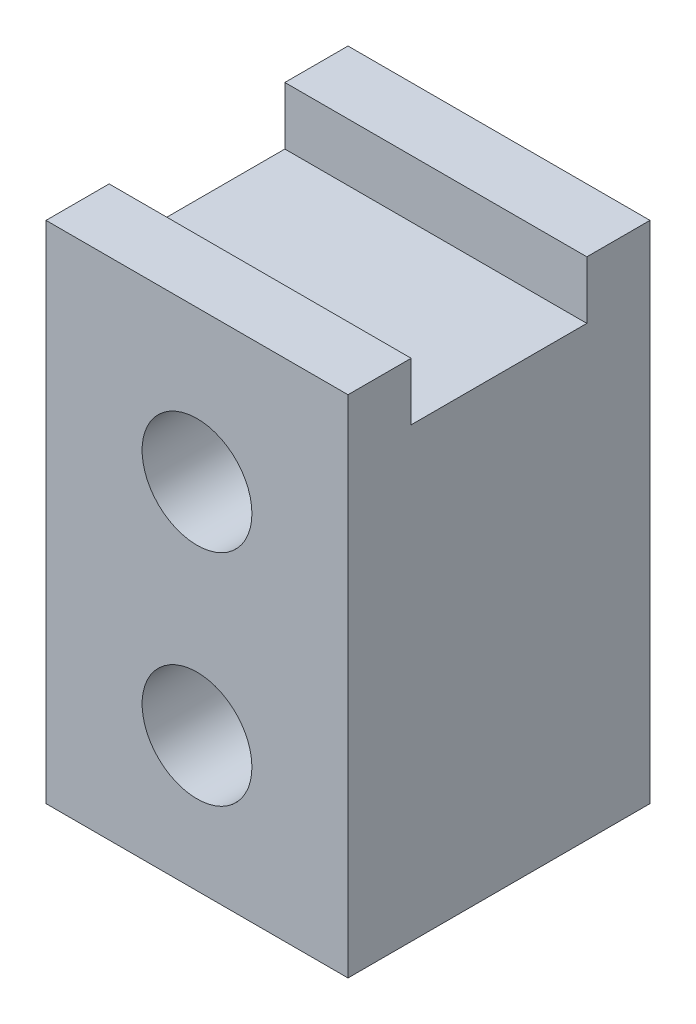
ISO-10303-21;
HEADER;
FILE_DESCRIPTION(('STEP AP214'),'2;1');
FILE_NAME('part.step','',(''),(''),'','','');
FILE_SCHEMA(('AUTOMOTIVE_DESIGN { 1 0 10303 214 1 1 1 1 }'));
ENDSEC;
DATA;
#1=APPLICATION_CONTEXT('core data for automotive mechanical design processes');
#2=APPLICATION_PROTOCOL_DEFINITION('international standard','automotive_design',2000,#1);
#3=PRODUCT_CONTEXT('',#1,'mechanical');
#4=PRODUCT('Part','Part','',(#3));
#5=PRODUCT_RELATED_PRODUCT_CATEGORY('part','',(#4));
#6=PRODUCT_DEFINITION_FORMATION('','',#4);
#7=PRODUCT_DEFINITION_CONTEXT('part definition',#1,'design');
#8=PRODUCT_DEFINITION('design','',#6,#7);
#9=PRODUCT_DEFINITION_SHAPE('','',#8);
#10=(LENGTH_UNIT() NAMED_UNIT(*) SI_UNIT(.MILLI.,.METRE.));
#11=(NAMED_UNIT(*) PLANE_ANGLE_UNIT() SI_UNIT($,.RADIAN.));
#12=(NAMED_UNIT(*) SI_UNIT($,.STERADIAN.) SOLID_ANGLE_UNIT());
#13=UNCERTAINTY_MEASURE_WITH_UNIT(LENGTH_MEASURE(1.E-05),#10,'distance_accuracy_value','');
#14=(GEOMETRIC_REPRESENTATION_CONTEXT(3) GLOBAL_UNCERTAINTY_ASSIGNED_CONTEXT((#13)) GLOBAL_UNIT_ASSIGNED_CONTEXT((#10,
#11,#12)) REPRESENTATION_CONTEXT('',''));
#15=CARTESIAN_POINT('',(0.,0.,0.));
#16=DIRECTION('',(0.,0.,1.));
#17=DIRECTION('',(1.,0.,0.));
#18=AXIS2_PLACEMENT_3D('',#15,#16,#17);
#19=CARTESIAN_POINT('',(-27.5,46.,55.));
#20=DIRECTION('',(0.,-1.,0.));
#21=DIRECTION('',(0.,0.,-1.));
#22=AXIS2_PLACEMENT_3D('',#19,#20,#21);
#23=PLANE('',#22);
#24=DIRECTION('',(0.,0.,-1.));
#25=VECTOR('',#24,1.);
#26=CARTESIAN_POINT('',(-27.5,46.,55.));
#27=LINE('',#26,#25);
#28=CARTESIAN_POINT('',(-27.5,46.,11.5));
#29=VERTEX_POINT('',#28);
#30=CARTESIAN_POINT('',(-27.5,46.,0.));
#31=VERTEX_POINT('',#30);
#32=EDGE_CURVE('E168',#29,#31,#27,.T.);
#33=ORIENTED_EDGE('',*,*,#32,.F.);
#34=DIRECTION('',(-1.,0.,0.));
#35=VECTOR('',#34,1.);
#36=CARTESIAN_POINT('',(27.5,46.,11.5));
#37=LINE('',#36,#35);
#38=CARTESIAN_POINT('',(27.5,46.,11.5));
#39=VERTEX_POINT('',#38);
#40=EDGE_CURVE('E133',#39,#29,#37,.T.);
#41=ORIENTED_EDGE('',*,*,#40,.F.);
#42=DIRECTION('',(0.,0.,-1.));
#43=VECTOR('',#42,1.);
#44=CARTESIAN_POINT('',(27.5,46.,55.));
#45=LINE('',#44,#43);
#46=CARTESIAN_POINT('',(27.5,46.,0.));
#47=VERTEX_POINT('',#46);
#48=EDGE_CURVE('E41',#39,#47,#45,.T.);
#49=ORIENTED_EDGE('',*,*,#48,.T.);
#50=DIRECTION('',(-1.,0.,0.));
#51=VECTOR('',#50,1.);
#52=CARTESIAN_POINT('',(-27.5,46.,0.));
#53=LINE('',#52,#51);
#54=EDGE_CURVE('E160',#47,#31,#53,.T.);
#55=ORIENTED_EDGE('',*,*,#54,.T.);
#56=EDGE_LOOP('',(#33,#41,#49,#55));
#57=FACE_BOUND('',#56,.T.);
#58=ADVANCED_FACE('F33',(#57),#23,.F.);
#59=CARTESIAN_POINT('',(0.,0.,55.));
#60=DIRECTION('',(0.,0.,-1.));
#61=DIRECTION('',(-1.,0.,0.));
#62=AXIS2_PLACEMENT_3D('',#59,#60,#61);
#63=PLANE('',#62);
#64=CARTESIAN_POINT('',(0.,18.5,55.));
#65=DIRECTION('',(0.,0.,1.));
#66=DIRECTION('',(1.,0.,0.));
#67=AXIS2_PLACEMENT_3D('',#64,#65,#66);
#68=CIRCLE('',#67,10.);
#69=CARTESIAN_POINT('',(10.,18.5,55.));
#70=VERTEX_POINT('',#69);
#71=EDGE_CURVE('E146',#70,#70,#68,.T.);
#72=ORIENTED_EDGE('',*,*,#71,.F.);
#73=EDGE_LOOP('',(#72));
#74=FACE_BOUND('',#73,.T.);
#75=DIRECTION('',(0.,1.,0.));
#76=VECTOR('',#75,1.);
#77=CARTESIAN_POINT('',(27.5,-46.,55.));
#78=LINE('',#77,#76);
#79=CARTESIAN_POINT('',(27.5,-46.,55.));
#80=VERTEX_POINT('',#79);
#81=CARTESIAN_POINT('',(27.5,46.,55.));
#82=VERTEX_POINT('',#81);
#83=EDGE_CURVE('E152',#80,#82,#78,.T.);
#84=ORIENTED_EDGE('',*,*,#83,.T.);
#85=DIRECTION('',(-1.,0.,0.));
#86=VECTOR('',#85,1.);
#87=CARTESIAN_POINT('',(-27.5,46.,55.));
#88=LINE('',#87,#86);
#89=CARTESIAN_POINT('',(-27.5,46.,55.));
#90=VERTEX_POINT('',#89);
#91=EDGE_CURVE('E85',#82,#90,#88,.T.);
#92=ORIENTED_EDGE('',*,*,#91,.T.);
#93=DIRECTION('',(0.,-1.,0.));
#94=VECTOR('',#93,1.);
#95=CARTESIAN_POINT('',(-27.5,-46.,55.));
#96=LINE('',#95,#94);
#97=CARTESIAN_POINT('',(-27.5,-46.,55.));
#98=VERTEX_POINT('',#97);
#99=EDGE_CURVE('E155',#90,#98,#96,.T.);
#100=ORIENTED_EDGE('',*,*,#99,.T.);
#101=DIRECTION('',(1.,0.,0.));
#102=VECTOR('',#101,1.);
#103=CARTESIAN_POINT('',(-27.5,-46.,55.));
#104=LINE('',#103,#102);
#105=EDGE_CURVE('E57',#98,#80,#104,.T.);
#106=ORIENTED_EDGE('',*,*,#105,.T.);
#107=EDGE_LOOP('',(#84,#92,#100,#106));
#108=FACE_BOUND('',#107,.T.);
#109=CARTESIAN_POINT('',(0.,-21.5,55.));
#110=DIRECTION('',(0.,0.,1.));
#111=DIRECTION('',(1.,0.,0.));
#112=AXIS2_PLACEMENT_3D('',#109,#110,#111);
#113=CIRCLE('',#112,10.);
#114=CARTESIAN_POINT('',(10.,-21.5,55.));
#115=VERTEX_POINT('',#114);
#116=EDGE_CURVE('E140',#115,#115,#113,.T.);
#117=ORIENTED_EDGE('',*,*,#116,.F.);
#118=EDGE_LOOP('',(#117));
#119=FACE_BOUND('',#118,.T.);
#120=ADVANCED_FACE('F187',(#74,#108,#119),#63,.F.);
#121=CARTESIAN_POINT('',(0.,0.,0.));
#122=DIRECTION('',(0.,0.,-1.));
#123=DIRECTION('',(-1.,0.,0.));
#124=AXIS2_PLACEMENT_3D('',#121,#122,#123);
#125=PLANE('',#124);
#126=CARTESIAN_POINT('',(0.,18.5,0.));
#127=DIRECTION('',(0.,0.,1.));
#128=DIRECTION('',(1.,0.,0.));
#129=AXIS2_PLACEMENT_3D('',#126,#127,#128);
#130=CIRCLE('',#129,10.);
#131=CARTESIAN_POINT('',(10.,18.5,0.));
#132=VERTEX_POINT('',#131);
#133=EDGE_CURVE('E143',#132,#132,#130,.T.);
#134=ORIENTED_EDGE('',*,*,#133,.T.);
#135=EDGE_LOOP('',(#134));
#136=FACE_BOUND('',#135,.T.);
#137=DIRECTION('',(0.,1.,0.));
#138=VECTOR('',#137,1.);
#139=CARTESIAN_POINT('',(27.5,-46.,0.));
#140=LINE('',#139,#138);
#141=CARTESIAN_POINT('',(27.5,-46.,0.));
#142=VERTEX_POINT('',#141);
#143=EDGE_CURVE('E149',#142,#47,#140,.T.);
#144=ORIENTED_EDGE('',*,*,#143,.F.);
#145=DIRECTION('',(1.,0.,0.));
#146=VECTOR('',#145,1.);
#147=CARTESIAN_POINT('',(-27.5,-46.,0.));
#148=LINE('',#147,#146);
#149=CARTESIAN_POINT('',(-27.5,-46.,0.));
#150=VERTEX_POINT('',#149);
#151=EDGE_CURVE('E78',#150,#142,#148,.T.);
#152=ORIENTED_EDGE('',*,*,#151,.F.);
#153=DIRECTION('',(0.,-1.,0.));
#154=VECTOR('',#153,1.);
#155=CARTESIAN_POINT('',(-27.5,-46.,0.));
#156=LINE('',#155,#154);
#157=EDGE_CURVE('E163',#31,#150,#156,.T.);
#158=ORIENTED_EDGE('',*,*,#157,.F.);
#159=ORIENTED_EDGE('',*,*,#54,.F.);
#160=EDGE_LOOP('',(#144,#152,#158,#159));
#161=FACE_BOUND('',#160,.T.);
#162=CARTESIAN_POINT('',(0.,-21.5,0.));
#163=DIRECTION('',(0.,0.,1.));
#164=DIRECTION('',(1.,0.,0.));
#165=AXIS2_PLACEMENT_3D('',#162,#163,#164);
#166=CIRCLE('',#165,10.);
#167=CARTESIAN_POINT('',(10.,-21.5,0.));
#168=VERTEX_POINT('',#167);
#169=EDGE_CURVE('E135',#168,#168,#166,.T.);
#170=ORIENTED_EDGE('',*,*,#169,.T.);
#171=EDGE_LOOP('',(#170));
#172=FACE_BOUND('',#171,.T.);
#173=ADVANCED_FACE('F182',(#136,#161,#172),#125,.T.);
#174=CARTESIAN_POINT('',(27.5,-46.,55.));
#175=DIRECTION('',(-1.,0.,0.));
#176=DIRECTION('',(0.,-1.,0.));
#177=AXIS2_PLACEMENT_3D('',#174,#175,#176);
#178=PLANE('',#177);
#179=ORIENTED_EDGE('',*,*,#48,.F.);
#180=DIRECTION('',(0.,-1.,0.));
#181=VECTOR('',#180,1.);
#182=CARTESIAN_POINT('',(27.5,46.,11.5));
#183=LINE('',#182,#181);
#184=CARTESIAN_POINT('',(27.5,35.5,11.5));
#185=VERTEX_POINT('',#184);
#186=EDGE_CURVE('E108',#39,#185,#183,.T.);
#187=ORIENTED_EDGE('',*,*,#186,.T.);
#188=DIRECTION('',(0.,0.,1.));
#189=VECTOR('',#188,1.);
#190=CARTESIAN_POINT('',(27.5,35.5,11.5));
#191=LINE('',#190,#189);
#192=CARTESIAN_POINT('',(27.5,35.5,43.5));
#193=VERTEX_POINT('',#192);
#194=EDGE_CURVE('E117',#185,#193,#191,.T.);
#195=ORIENTED_EDGE('',*,*,#194,.T.);
#196=DIRECTION('',(0.,1.,0.));
#197=VECTOR('',#196,1.);
#198=CARTESIAN_POINT('',(27.5,46.,43.5));
#199=LINE('',#198,#197);
#200=CARTESIAN_POINT('',(27.5,46.,43.5));
#201=VERTEX_POINT('',#200);
#202=EDGE_CURVE('E114',#193,#201,#199,.T.);
#203=ORIENTED_EDGE('',*,*,#202,.T.);
#204=EDGE_CURVE('E11',#82,#201,#45,.T.);
#205=ORIENTED_EDGE('',*,*,#204,.F.);
#206=ORIENTED_EDGE('',*,*,#83,.F.);
#207=DIRECTION('',(0.,0.,-1.));
#208=VECTOR('',#207,1.);
#209=CARTESIAN_POINT('',(27.5,-46.,55.));
#210=LINE('',#209,#208);
#211=EDGE_CURVE('E158',#80,#142,#210,.T.);
#212=ORIENTED_EDGE('',*,*,#211,.T.);
#213=ORIENTED_EDGE('',*,*,#143,.T.);
#214=EDGE_LOOP('',(#179,#187,#195,#203,#205,#206,#212,#213));
#215=FACE_BOUND('',#214,.T.);
#216=ADVANCED_FACE('F35',(#215),#178,.F.);
#217=ORIENTED_EDGE('',*,*,#204,.T.);
#218=DIRECTION('',(-1.,0.,0.));
#219=VECTOR('',#218,1.);
#220=CARTESIAN_POINT('',(27.5,46.,43.5));
#221=LINE('',#220,#219);
#222=CARTESIAN_POINT('',(-27.5,46.,43.5));
#223=VERTEX_POINT('',#222);
#224=EDGE_CURVE('E136',#201,#223,#221,.T.);
#225=ORIENTED_EDGE('',*,*,#224,.T.);
#226=EDGE_CURVE('E169',#90,#223,#27,.T.);
#227=ORIENTED_EDGE('',*,*,#226,.F.);
#228=ORIENTED_EDGE('',*,*,#91,.F.);
#229=EDGE_LOOP('',(#217,#225,#227,#228));
#230=FACE_BOUND('',#229,.T.);
#231=ADVANCED_FACE('F189',(#230),#23,.F.);
#232=CARTESIAN_POINT('',(-27.5,-46.,55.));
#233=DIRECTION('',(1.,0.,0.));
#234=DIRECTION('',(0.,1.,0.));
#235=AXIS2_PLACEMENT_3D('',#232,#233,#234);
#236=PLANE('',#235);
#237=DIRECTION('',(0.,0.,1.));
#238=VECTOR('',#237,1.);
#239=CARTESIAN_POINT('',(-27.5,35.5,11.5));
#240=LINE('',#239,#238);
#241=CARTESIAN_POINT('',(-27.5,35.5,11.5));
#242=VERTEX_POINT('',#241);
#243=CARTESIAN_POINT('',(-27.5,35.5,43.5));
#244=VERTEX_POINT('',#243);
#245=EDGE_CURVE('E127',#242,#244,#240,.T.);
#246=ORIENTED_EDGE('',*,*,#245,.F.);
#247=DIRECTION('',(0.,-1.,0.));
#248=VECTOR('',#247,1.);
#249=CARTESIAN_POINT('',(-27.5,46.,11.5));
#250=LINE('',#249,#248);
#251=EDGE_CURVE('E48',#29,#242,#250,.T.);
#252=ORIENTED_EDGE('',*,*,#251,.F.);
#253=ORIENTED_EDGE('',*,*,#32,.T.);
#254=ORIENTED_EDGE('',*,*,#157,.T.);
#255=DIRECTION('',(0.,0.,-1.));
#256=VECTOR('',#255,1.);
#257=CARTESIAN_POINT('',(-27.5,-46.,55.));
#258=LINE('',#257,#256);
#259=EDGE_CURVE('E167',#98,#150,#258,.T.);
#260=ORIENTED_EDGE('',*,*,#259,.F.);
#261=ORIENTED_EDGE('',*,*,#99,.F.);
#262=ORIENTED_EDGE('',*,*,#226,.T.);
#263=DIRECTION('',(0.,1.,0.));
#264=VECTOR('',#263,1.);
#265=CARTESIAN_POINT('',(-27.5,46.,43.5));
#266=LINE('',#265,#264);
#267=EDGE_CURVE('E125',#244,#223,#266,.T.);
#268=ORIENTED_EDGE('',*,*,#267,.F.);
#269=EDGE_LOOP('',(#246,#252,#253,#254,#260,#261,#262,#268));
#270=FACE_BOUND('',#269,.T.);
#271=ADVANCED_FACE('F175',(#270),#236,.F.);
#272=CARTESIAN_POINT('',(-27.5,-46.,55.));
#273=DIRECTION('',(0.,1.,0.));
#274=DIRECTION('',(0.,0.,1.));
#275=AXIS2_PLACEMENT_3D('',#272,#273,#274);
#276=PLANE('',#275);
#277=ORIENTED_EDGE('',*,*,#151,.T.);
#278=ORIENTED_EDGE('',*,*,#211,.F.);
#279=ORIENTED_EDGE('',*,*,#105,.F.);
#280=ORIENTED_EDGE('',*,*,#259,.T.);
#281=EDGE_LOOP('',(#277,#278,#279,#280));
#282=FACE_BOUND('',#281,.T.);
#283=ADVANCED_FACE('F186',(#282),#276,.F.);
#284=CARTESIAN_POINT('',(0.,18.5,55.));
#285=DIRECTION('',(0.,0.,-1.));
#286=DIRECTION('',(-1.,0.,0.));
#287=AXIS2_PLACEMENT_3D('',#284,#285,#286);
#288=CYLINDRICAL_SURFACE('',#287,10.);
#289=ORIENTED_EDGE('',*,*,#71,.T.);
#290=EDGE_LOOP('',(#289));
#291=FACE_BOUND('',#290,.T.);
#292=ORIENTED_EDGE('',*,*,#133,.F.);
#293=EDGE_LOOP('',(#292));
#294=FACE_BOUND('',#293,.T.);
#295=ADVANCED_FACE('F223',(#291,#294),#288,.F.);
#296=CARTESIAN_POINT('',(0.,-21.5,55.));
#297=DIRECTION('',(0.,0.,-1.));
#298=DIRECTION('',(-1.,0.,0.));
#299=AXIS2_PLACEMENT_3D('',#296,#297,#298);
#300=CYLINDRICAL_SURFACE('',#299,10.);
#301=ORIENTED_EDGE('',*,*,#116,.T.);
#302=EDGE_LOOP('',(#301));
#303=FACE_BOUND('',#302,.T.);
#304=ORIENTED_EDGE('',*,*,#169,.F.);
#305=EDGE_LOOP('',(#304));
#306=FACE_BOUND('',#305,.T.);
#307=ADVANCED_FACE('F199',(#303,#306),#300,.F.);
#308=CARTESIAN_POINT('',(27.5,46.,11.5));
#309=DIRECTION('',(0.,0.,-1.));
#310=DIRECTION('',(0.,1.,0.));
#311=AXIS2_PLACEMENT_3D('',#308,#309,#310);
#312=PLANE('',#311);
#313=ORIENTED_EDGE('',*,*,#251,.T.);
#314=DIRECTION('',(-1.,0.,0.));
#315=VECTOR('',#314,1.);
#316=CARTESIAN_POINT('',(27.5,35.5,11.5));
#317=LINE('',#316,#315);
#318=EDGE_CURVE('E104',#185,#242,#317,.T.);
#319=ORIENTED_EDGE('',*,*,#318,.F.);
#320=ORIENTED_EDGE('',*,*,#186,.F.);
#321=ORIENTED_EDGE('',*,*,#40,.T.);
#322=EDGE_LOOP('',(#313,#319,#320,#321));
#323=FACE_BOUND('',#322,.T.);
#324=ADVANCED_FACE('F106',(#323),#312,.F.);
#325=CARTESIAN_POINT('',(27.5,46.,43.5));
#326=DIRECTION('',(0.,0.,1.));
#327=DIRECTION('',(1.,0.,0.));
#328=AXIS2_PLACEMENT_3D('',#325,#326,#327);
#329=PLANE('',#328);
#330=ORIENTED_EDGE('',*,*,#267,.T.);
#331=ORIENTED_EDGE('',*,*,#224,.F.);
#332=ORIENTED_EDGE('',*,*,#202,.F.);
#333=DIRECTION('',(-1.,0.,0.));
#334=VECTOR('',#333,1.);
#335=CARTESIAN_POINT('',(27.5,35.5,43.5));
#336=LINE('',#335,#334);
#337=EDGE_CURVE('E113',#193,#244,#336,.T.);
#338=ORIENTED_EDGE('',*,*,#337,.T.);
#339=EDGE_LOOP('',(#330,#331,#332,#338));
#340=FACE_BOUND('',#339,.T.);
#341=ADVANCED_FACE('F191',(#340),#329,.F.);
#342=CARTESIAN_POINT('',(27.5,35.5,11.5));
#343=DIRECTION('',(0.,-1.,0.));
#344=DIRECTION('',(1.,0.,0.));
#345=AXIS2_PLACEMENT_3D('',#342,#343,#344);
#346=PLANE('',#345);
#347=ORIENTED_EDGE('',*,*,#245,.T.);
#348=ORIENTED_EDGE('',*,*,#337,.F.);
#349=ORIENTED_EDGE('',*,*,#194,.F.);
#350=ORIENTED_EDGE('',*,*,#318,.T.);
#351=EDGE_LOOP('',(#347,#348,#349,#350));
#352=FACE_BOUND('',#351,.T.);
#353=ADVANCED_FACE('F118',(#352),#346,.F.);
#354=CLOSED_SHELL('',(#58,#120,#173,#216,#231,#271,#283,#295,#307,#324,#341,#353));
#355=MANIFOLD_SOLID_BREP('B2',#354);
#356=ADVANCED_BREP_SHAPE_REPRESENTATION('',(#18,#355),#14);
#357=SHAPE_DEFINITION_REPRESENTATION(#9,#356);
ENDSEC;
END-ISO-10303-21;
